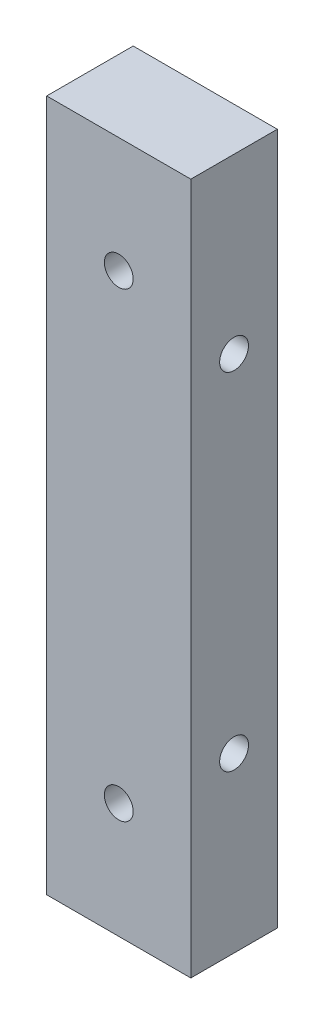
ISO-10303-21;
HEADER;
FILE_DESCRIPTION(('STEP AP214'),'2;1');
FILE_NAME('part.step','',(''),(''),'','','');
FILE_SCHEMA(('AUTOMOTIVE_DESIGN { 1 0 10303 214 1 1 1 1 }'));
ENDSEC;
DATA;
#1=APPLICATION_CONTEXT('core data for automotive mechanical design processes');
#2=APPLICATION_PROTOCOL_DEFINITION('international standard','automotive_design',2000,#1);
#3=PRODUCT_CONTEXT('',#1,'mechanical');
#4=PRODUCT('Part','Part','',(#3));
#5=PRODUCT_RELATED_PRODUCT_CATEGORY('part','',(#4));
#6=PRODUCT_DEFINITION_FORMATION('','',#4);
#7=PRODUCT_DEFINITION_CONTEXT('part definition',#1,'design');
#8=PRODUCT_DEFINITION('design','',#6,#7);
#9=PRODUCT_DEFINITION_SHAPE('','',#8);
#10=(LENGTH_UNIT() NAMED_UNIT(*) SI_UNIT(.MILLI.,.METRE.));
#11=(NAMED_UNIT(*) PLANE_ANGLE_UNIT() SI_UNIT($,.RADIAN.));
#12=(NAMED_UNIT(*) SI_UNIT($,.STERADIAN.) SOLID_ANGLE_UNIT());
#13=UNCERTAINTY_MEASURE_WITH_UNIT(LENGTH_MEASURE(1.E-05),#10,'distance_accuracy_value','');
#14=(GEOMETRIC_REPRESENTATION_CONTEXT(3) GLOBAL_UNCERTAINTY_ASSIGNED_CONTEXT((#13)) GLOBAL_UNIT_ASSIGNED_CONTEXT((#10,
#11,#12)) REPRESENTATION_CONTEXT('',''));
#15=CARTESIAN_POINT('',(0.,0.,0.));
#16=DIRECTION('',(0.,0.,1.));
#17=DIRECTION('',(1.,0.,0.));
#18=AXIS2_PLACEMENT_3D('',#15,#16,#17);
#19=CARTESIAN_POINT('',(12.5,60.,7.5));
#20=DIRECTION('',(-1.,0.,0.));
#21=DIRECTION('',(0.,0.,1.));
#22=AXIS2_PLACEMENT_3D('',#19,#20,#21);
#23=PLANE('',#22);
#24=CARTESIAN_POINT('',(12.5,30.,0.));
#25=DIRECTION('',(-1.,0.,0.));
#26=DIRECTION('',(0.,0.,1.));
#27=AXIS2_PLACEMENT_3D('',#24,#25,#26);
#28=CIRCLE('',#27,2.5);
#29=CARTESIAN_POINT('',(12.5,30.,2.49999999999998));
#30=VERTEX_POINT('',#29);
#31=EDGE_CURVE('E127',#30,#30,#28,.T.);
#32=ORIENTED_EDGE('',*,*,#31,.T.);
#33=EDGE_LOOP('',(#32));
#34=FACE_BOUND('',#33,.T.);
#35=CARTESIAN_POINT('',(12.5,-30.,0.));
#36=DIRECTION('',(-1.,0.,0.));
#37=DIRECTION('',(0.,0.,1.));
#38=AXIS2_PLACEMENT_3D('',#35,#36,#37);
#39=CIRCLE('',#38,2.5);
#40=CARTESIAN_POINT('',(12.5,-30.,2.5));
#41=VERTEX_POINT('',#40);
#42=EDGE_CURVE('E111',#41,#41,#39,.T.);
#43=ORIENTED_EDGE('',*,*,#42,.T.);
#44=EDGE_LOOP('',(#43));
#45=FACE_BOUND('',#44,.T.);
#46=DIRECTION('',(0.,0.,-1.));
#47=VECTOR('',#46,1.);
#48=CARTESIAN_POINT('',(12.5,-60.,7.5));
#49=LINE('',#48,#47);
#50=CARTESIAN_POINT('',(12.5,-60.,7.5));
#51=VERTEX_POINT('',#50);
#52=CARTESIAN_POINT('',(12.5,-60.,-7.5));
#53=VERTEX_POINT('',#52);
#54=EDGE_CURVE('E108',#51,#53,#49,.T.);
#55=ORIENTED_EDGE('',*,*,#54,.T.);
#56=DIRECTION('',(0.,-1.,0.));
#57=VECTOR('',#56,1.);
#58=CARTESIAN_POINT('',(12.5,60.,-7.5));
#59=LINE('',#58,#57);
#60=CARTESIAN_POINT('',(12.5,60.,-7.5));
#61=VERTEX_POINT('',#60);
#62=EDGE_CURVE('E11',#61,#53,#59,.T.);
#63=ORIENTED_EDGE('',*,*,#62,.F.);
#64=DIRECTION('',(0.,0.,-1.));
#65=VECTOR('',#64,1.);
#66=CARTESIAN_POINT('',(12.5,60.,7.5));
#67=LINE('',#66,#65);
#68=CARTESIAN_POINT('',(12.5,60.,7.5));
#69=VERTEX_POINT('',#68);
#70=EDGE_CURVE('E96',#69,#61,#67,.T.);
#71=ORIENTED_EDGE('',*,*,#70,.F.);
#72=DIRECTION('',(0.,-1.,0.));
#73=VECTOR('',#72,1.);
#74=CARTESIAN_POINT('',(12.5,60.,7.5));
#75=LINE('',#74,#73);
#76=EDGE_CURVE('E104',#69,#51,#75,.T.);
#77=ORIENTED_EDGE('',*,*,#76,.T.);
#78=EDGE_LOOP('',(#55,#63,#71,#77));
#79=FACE_BOUND('',#78,.T.);
#80=ADVANCED_FACE('F45',(#34,#45,#79),#23,.F.);
#81=CARTESIAN_POINT('',(-12.5,60.,-7.5));
#82=DIRECTION('',(0.,0.,1.));
#83=DIRECTION('',(1.,0.,0.));
#84=AXIS2_PLACEMENT_3D('',#81,#82,#83);
#85=PLANE('',#84);
#86=CARTESIAN_POINT('',(-7.49400541621981E-13,39.9999999999999,-7.5));
#87=DIRECTION('',(0.,0.,1.));
#88=DIRECTION('',(1.,0.,0.));
#89=AXIS2_PLACEMENT_3D('',#86,#87,#88);
#90=CIRCLE('',#89,2.5);
#91=CARTESIAN_POINT('',(2.49999999999925,39.9999999999999,-7.5));
#92=VERTEX_POINT('',#91);
#93=EDGE_CURVE('E139',#92,#92,#90,.T.);
#94=ORIENTED_EDGE('',*,*,#93,.T.);
#95=EDGE_LOOP('',(#94));
#96=FACE_BOUND('',#95,.T.);
#97=CARTESIAN_POINT('',(-7.7715611723761E-13,-40.0000000000001,-7.5));
#98=DIRECTION('',(0.,0.,1.));
#99=DIRECTION('',(1.,0.,0.));
#100=AXIS2_PLACEMENT_3D('',#97,#98,#99);
#101=CIRCLE('',#100,2.5);
#102=CARTESIAN_POINT('',(2.49999999999922,-40.0000000000001,-7.5));
#103=VERTEX_POINT('',#102);
#104=EDGE_CURVE('E133',#103,#103,#101,.T.);
#105=ORIENTED_EDGE('',*,*,#104,.T.);
#106=EDGE_LOOP('',(#105));
#107=FACE_BOUND('',#106,.T.);
#108=DIRECTION('',(-1.,0.,0.));
#109=VECTOR('',#108,1.);
#110=CARTESIAN_POINT('',(-12.5,-60.,-7.5));
#111=LINE('',#110,#109);
#112=CARTESIAN_POINT('',(-12.5,-60.,-7.5));
#113=VERTEX_POINT('',#112);
#114=EDGE_CURVE('E100',#53,#113,#111,.T.);
#115=ORIENTED_EDGE('',*,*,#114,.T.);
#116=DIRECTION('',(0.,-1.,0.));
#117=VECTOR('',#116,1.);
#118=CARTESIAN_POINT('',(-12.5,60.,-7.5));
#119=LINE('',#118,#117);
#120=CARTESIAN_POINT('',(-12.5,60.,-7.5));
#121=VERTEX_POINT('',#120);
#122=EDGE_CURVE('E53',#121,#113,#119,.T.);
#123=ORIENTED_EDGE('',*,*,#122,.F.);
#124=DIRECTION('',(-1.,0.,0.));
#125=VECTOR('',#124,1.);
#126=CARTESIAN_POINT('',(-12.5,60.,-7.5));
#127=LINE('',#126,#125);
#128=EDGE_CURVE('E91',#61,#121,#127,.T.);
#129=ORIENTED_EDGE('',*,*,#128,.F.);
#130=ORIENTED_EDGE('',*,*,#62,.T.);
#131=EDGE_LOOP('',(#115,#123,#129,#130));
#132=FACE_BOUND('',#131,.T.);
#133=ADVANCED_FACE('F99',(#96,#107,#132),#85,.F.);
#134=CARTESIAN_POINT('',(-12.5,60.,7.5));
#135=DIRECTION('',(1.,0.,0.));
#136=DIRECTION('',(0.,0.,-1.));
#137=AXIS2_PLACEMENT_3D('',#134,#135,#136);
#138=PLANE('',#137);
#139=CARTESIAN_POINT('',(-12.5,30.,0.));
#140=DIRECTION('',(-1.,0.,0.));
#141=DIRECTION('',(0.,0.,1.));
#142=AXIS2_PLACEMENT_3D('',#139,#140,#141);
#143=CIRCLE('',#142,2.49999999999999);
#144=CARTESIAN_POINT('',(-12.5,30.,2.49999999999998));
#145=VERTEX_POINT('',#144);
#146=EDGE_CURVE('E130',#145,#145,#143,.T.);
#147=ORIENTED_EDGE('',*,*,#146,.F.);
#148=EDGE_LOOP('',(#147));
#149=FACE_BOUND('',#148,.T.);
#150=CARTESIAN_POINT('',(-12.5,-30.,0.));
#151=DIRECTION('',(-1.,0.,0.));
#152=DIRECTION('',(0.,0.,1.));
#153=AXIS2_PLACEMENT_3D('',#150,#151,#152);
#154=CIRCLE('',#153,2.49999999999999);
#155=CARTESIAN_POINT('',(-12.5,-30.,2.49999999999999));
#156=VERTEX_POINT('',#155);
#157=EDGE_CURVE('E124',#156,#156,#154,.T.);
#158=ORIENTED_EDGE('',*,*,#157,.F.);
#159=EDGE_LOOP('',(#158));
#160=FACE_BOUND('',#159,.T.);
#161=DIRECTION('',(0.,0.,1.));
#162=VECTOR('',#161,1.);
#163=CARTESIAN_POINT('',(-12.5,-60.,7.5));
#164=LINE('',#163,#162);
#165=CARTESIAN_POINT('',(-12.5,-60.,7.5));
#166=VERTEX_POINT('',#165);
#167=EDGE_CURVE('E78',#113,#166,#164,.T.);
#168=ORIENTED_EDGE('',*,*,#167,.T.);
#169=DIRECTION('',(0.,-1.,0.));
#170=VECTOR('',#169,1.);
#171=CARTESIAN_POINT('',(-12.5,60.,7.5));
#172=LINE('',#171,#170);
#173=CARTESIAN_POINT('',(-12.5,60.,7.5));
#174=VERTEX_POINT('',#173);
#175=EDGE_CURVE('E101',#174,#166,#172,.T.);
#176=ORIENTED_EDGE('',*,*,#175,.F.);
#177=DIRECTION('',(0.,0.,1.));
#178=VECTOR('',#177,1.);
#179=CARTESIAN_POINT('',(-12.5,60.,7.5));
#180=LINE('',#179,#178);
#181=EDGE_CURVE('E94',#121,#174,#180,.T.);
#182=ORIENTED_EDGE('',*,*,#181,.F.);
#183=ORIENTED_EDGE('',*,*,#122,.T.);
#184=EDGE_LOOP('',(#168,#176,#182,#183));
#185=FACE_BOUND('',#184,.T.);
#186=ADVANCED_FACE('F102',(#149,#160,#185),#138,.F.);
#187=CARTESIAN_POINT('',(-12.5,60.,7.5));
#188=DIRECTION('',(0.,0.,-1.));
#189=DIRECTION('',(-1.,0.,0.));
#190=AXIS2_PLACEMENT_3D('',#187,#188,#189);
#191=PLANE('',#190);
#192=CARTESIAN_POINT('',(-7.49400541621981E-13,39.9999999999999,7.5));
#193=DIRECTION('',(0.,0.,1.));
#194=DIRECTION('',(1.,0.,0.));
#195=AXIS2_PLACEMENT_3D('',#192,#193,#194);
#196=CIRCLE('',#195,2.49999999999999);
#197=CARTESIAN_POINT('',(2.49999999999924,39.9999999999999,7.5));
#198=VERTEX_POINT('',#197);
#199=EDGE_CURVE('E142',#198,#198,#196,.T.);
#200=ORIENTED_EDGE('',*,*,#199,.F.);
#201=EDGE_LOOP('',(#200));
#202=FACE_BOUND('',#201,.T.);
#203=CARTESIAN_POINT('',(-7.7715611723761E-13,-40.0000000000001,7.5));
#204=DIRECTION('',(0.,0.,1.));
#205=DIRECTION('',(1.,0.,0.));
#206=AXIS2_PLACEMENT_3D('',#203,#204,#205);
#207=CIRCLE('',#206,2.49999999999999);
#208=CARTESIAN_POINT('',(2.49999999999921,-40.0000000000001,7.5));
#209=VERTEX_POINT('',#208);
#210=EDGE_CURVE('E136',#209,#209,#207,.T.);
#211=ORIENTED_EDGE('',*,*,#210,.F.);
#212=EDGE_LOOP('',(#211));
#213=FACE_BOUND('',#212,.T.);
#214=DIRECTION('',(1.,0.,0.));
#215=VECTOR('',#214,1.);
#216=CARTESIAN_POINT('',(-12.5,-60.,7.5));
#217=LINE('',#216,#215);
#218=EDGE_CURVE('E84',#166,#51,#217,.T.);
#219=ORIENTED_EDGE('',*,*,#218,.T.);
#220=ORIENTED_EDGE('',*,*,#76,.F.);
#221=DIRECTION('',(1.,0.,0.));
#222=VECTOR('',#221,1.);
#223=CARTESIAN_POINT('',(-12.5,60.,7.5));
#224=LINE('',#223,#222);
#225=EDGE_CURVE('E61',#174,#69,#224,.T.);
#226=ORIENTED_EDGE('',*,*,#225,.F.);
#227=ORIENTED_EDGE('',*,*,#175,.T.);
#228=EDGE_LOOP('',(#219,#220,#226,#227));
#229=FACE_BOUND('',#228,.T.);
#230=ADVANCED_FACE('F116',(#202,#213,#229),#191,.F.);
#231=CARTESIAN_POINT('',(0.,60.,0.));
#232=DIRECTION('',(0.,-1.,0.));
#233=DIRECTION('',(0.,0.,-1.));
#234=AXIS2_PLACEMENT_3D('',#231,#232,#233);
#235=PLANE('',#234);
#236=ORIENTED_EDGE('',*,*,#70,.T.);
#237=ORIENTED_EDGE('',*,*,#128,.T.);
#238=ORIENTED_EDGE('',*,*,#181,.T.);
#239=ORIENTED_EDGE('',*,*,#225,.T.);
#240=EDGE_LOOP('',(#236,#237,#238,#239));
#241=FACE_BOUND('',#240,.T.);
#242=ADVANCED_FACE('F92',(#241),#235,.F.);
#243=CARTESIAN_POINT('',(0.,-60.,0.));
#244=DIRECTION('',(0.,-1.,0.));
#245=DIRECTION('',(0.,0.,-1.));
#246=AXIS2_PLACEMENT_3D('',#243,#244,#245);
#247=PLANE('',#246);
#248=ORIENTED_EDGE('',*,*,#54,.F.);
#249=ORIENTED_EDGE('',*,*,#218,.F.);
#250=ORIENTED_EDGE('',*,*,#167,.F.);
#251=ORIENTED_EDGE('',*,*,#114,.F.);
#252=EDGE_LOOP('',(#248,#249,#250,#251));
#253=FACE_BOUND('',#252,.T.);
#254=ADVANCED_FACE('F119',(#253),#247,.T.);
#255=CARTESIAN_POINT('',(-12.5,-30.,0.));
#256=DIRECTION('',(-1.,0.,0.));
#257=DIRECTION('',(0.,0.,1.));
#258=AXIS2_PLACEMENT_3D('',#255,#256,#257);
#259=CYLINDRICAL_SURFACE('',#258,2.49999999999999);
#260=ORIENTED_EDGE('',*,*,#42,.F.);
#261=EDGE_LOOP('',(#260));
#262=FACE_BOUND('',#261,.T.);
#263=ORIENTED_EDGE('',*,*,#157,.T.);
#264=EDGE_LOOP('',(#263));
#265=FACE_BOUND('',#264,.T.);
#266=ADVANCED_FACE('F164',(#262,#265),#259,.F.);
#267=CARTESIAN_POINT('',(-12.5,30.,0.));
#268=DIRECTION('',(-1.,0.,0.));
#269=DIRECTION('',(0.,0.,1.));
#270=AXIS2_PLACEMENT_3D('',#267,#268,#269);
#271=CYLINDRICAL_SURFACE('',#270,2.49999999999999);
#272=ORIENTED_EDGE('',*,*,#31,.F.);
#273=EDGE_LOOP('',(#272));
#274=FACE_BOUND('',#273,.T.);
#275=ORIENTED_EDGE('',*,*,#146,.T.);
#276=EDGE_LOOP('',(#275));
#277=FACE_BOUND('',#276,.T.);
#278=ADVANCED_FACE('F155',(#274,#277),#271,.F.);
#279=CARTESIAN_POINT('',(-7.7715611723761E-13,-40.0000000000001,7.5));
#280=DIRECTION('',(0.,0.,1.));
#281=DIRECTION('',(1.,0.,0.));
#282=AXIS2_PLACEMENT_3D('',#279,#280,#281);
#283=CYLINDRICAL_SURFACE('',#282,2.49999999999999);
#284=ORIENTED_EDGE('',*,*,#104,.F.);
#285=EDGE_LOOP('',(#284));
#286=FACE_BOUND('',#285,.T.);
#287=ORIENTED_EDGE('',*,*,#210,.T.);
#288=EDGE_LOOP('',(#287));
#289=FACE_BOUND('',#288,.T.);
#290=ADVANCED_FACE('F153',(#286,#289),#283,.F.);
#291=CARTESIAN_POINT('',(-7.49400541621981E-13,39.9999999999999,7.5));
#292=DIRECTION('',(0.,0.,1.));
#293=DIRECTION('',(1.,0.,0.));
#294=AXIS2_PLACEMENT_3D('',#291,#292,#293);
#295=CYLINDRICAL_SURFACE('',#294,2.49999999999999);
#296=ORIENTED_EDGE('',*,*,#93,.F.);
#297=EDGE_LOOP('',(#296));
#298=FACE_BOUND('',#297,.T.);
#299=ORIENTED_EDGE('',*,*,#199,.T.);
#300=EDGE_LOOP('',(#299));
#301=FACE_BOUND('',#300,.T.);
#302=ADVANCED_FACE('F146',(#298,#301),#295,.F.);
#303=CLOSED_SHELL('',(#80,#133,#186,#230,#242,#254,#266,#278,#290,#302));
#304=MANIFOLD_SOLID_BREP('B2',#303);
#305=ADVANCED_BREP_SHAPE_REPRESENTATION('',(#18,#304),#14);
#306=SHAPE_DEFINITION_REPRESENTATION(#9,#305);
ENDSEC;
END-ISO-10303-21;
